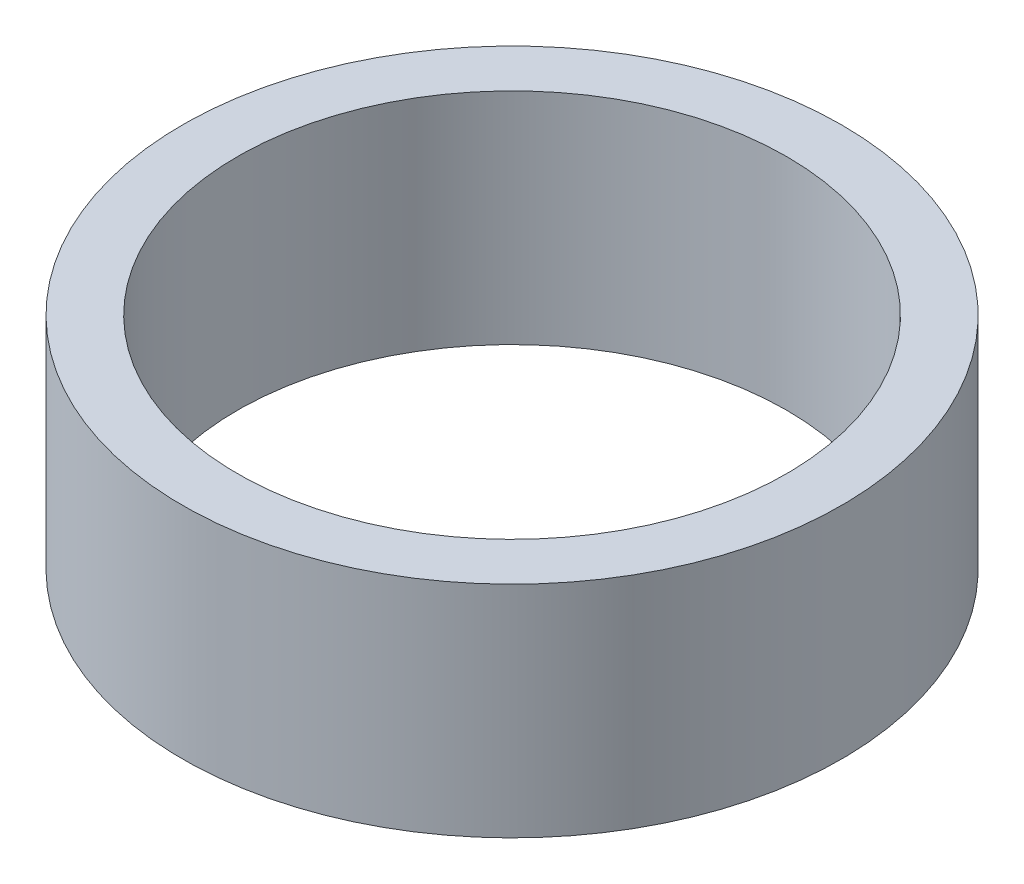
ISO-10303-21;
HEADER;
FILE_DESCRIPTION(('STEP AP214'),'2;1');
FILE_NAME('part.step','',(''),(''),'','','');
FILE_SCHEMA(('AUTOMOTIVE_DESIGN { 1 0 10303 214 1 1 1 1 }'));
ENDSEC;
DATA;
#1=APPLICATION_CONTEXT('core data for automotive mechanical design processes');
#2=APPLICATION_PROTOCOL_DEFINITION('international standard','automotive_design',2000,#1);
#3=PRODUCT_CONTEXT('',#1,'mechanical');
#4=PRODUCT('Part','Part','',(#3));
#5=PRODUCT_RELATED_PRODUCT_CATEGORY('part','',(#4));
#6=PRODUCT_DEFINITION_FORMATION('','',#4);
#7=PRODUCT_DEFINITION_CONTEXT('part definition',#1,'design');
#8=PRODUCT_DEFINITION('design','',#6,#7);
#9=PRODUCT_DEFINITION_SHAPE('','',#8);
#10=(LENGTH_UNIT() NAMED_UNIT(*) SI_UNIT(.MILLI.,.METRE.));
#11=(NAMED_UNIT(*) PLANE_ANGLE_UNIT() SI_UNIT($,.RADIAN.));
#12=(NAMED_UNIT(*) SI_UNIT($,.STERADIAN.) SOLID_ANGLE_UNIT());
#13=UNCERTAINTY_MEASURE_WITH_UNIT(LENGTH_MEASURE(1.E-05),#10,'distance_accuracy_value','');
#14=(GEOMETRIC_REPRESENTATION_CONTEXT(3) GLOBAL_UNCERTAINTY_ASSIGNED_CONTEXT((#13)) GLOBAL_UNIT_ASSIGNED_CONTEXT((#10,
#11,#12)) REPRESENTATION_CONTEXT('',''));
#15=CARTESIAN_POINT('',(0.,0.,0.));
#16=DIRECTION('',(0.,0.,1.));
#17=DIRECTION('',(1.,0.,0.));
#18=AXIS2_PLACEMENT_3D('',#15,#16,#17);
#19=CARTESIAN_POINT('',(0.,0.,0.));
#20=DIRECTION('',(0.,-1.,0.));
#21=DIRECTION('',(0.,0.,-1.));
#22=AXIS2_PLACEMENT_3D('',#19,#20,#21);
#23=CYLINDRICAL_SURFACE('',#22,1.25);
#24=CARTESIAN_POINT('',(0.,0.,0.));
#25=DIRECTION('',(0.,-1.,0.));
#26=DIRECTION('',(0.,0.,-1.));
#27=AXIS2_PLACEMENT_3D('',#24,#25,#26);
#28=CIRCLE('',#27,1.25);
#29=CARTESIAN_POINT('',(0.,0.,-1.25));
#30=VERTEX_POINT('',#29);
#31=EDGE_CURVE('E43',#30,#30,#28,.T.);
#32=ORIENTED_EDGE('',*,*,#31,.T.);
#33=EDGE_LOOP('',(#32));
#34=FACE_BOUND('',#33,.T.);
#35=CARTESIAN_POINT('',(0.,1.,0.));
#36=DIRECTION('',(0.,-1.,0.));
#37=DIRECTION('',(0.,0.,-1.));
#38=AXIS2_PLACEMENT_3D('',#35,#36,#37);
#39=CIRCLE('',#38,1.25);
#40=CARTESIAN_POINT('',(0.,1.,-1.25));
#41=VERTEX_POINT('',#40);
#42=EDGE_CURVE('E10',#41,#41,#39,.T.);
#43=ORIENTED_EDGE('',*,*,#42,.F.);
#44=EDGE_LOOP('',(#43));
#45=FACE_BOUND('',#44,.T.);
#46=ADVANCED_FACE('F29',(#34,#45),#23,.F.);
#47=CARTESIAN_POINT('',(1.25,1.,0.));
#48=DIRECTION('',(0.,1.,0.));
#49=DIRECTION('',(0.,0.,1.));
#50=AXIS2_PLACEMENT_3D('',#47,#48,#49);
#51=PLANE('',#50);
#52=ORIENTED_EDGE('',*,*,#42,.T.);
#53=EDGE_LOOP('',(#52));
#54=FACE_BOUND('',#53,.T.);
#55=CARTESIAN_POINT('',(0.,1.,0.));
#56=DIRECTION('',(0.,-1.,0.));
#57=DIRECTION('',(0.,0.,-1.));
#58=AXIS2_PLACEMENT_3D('',#55,#56,#57);
#59=CIRCLE('',#58,1.5);
#60=CARTESIAN_POINT('',(0.,1.,-1.5));
#61=VERTEX_POINT('',#60);
#62=EDGE_CURVE('E35',#61,#61,#59,.T.);
#63=ORIENTED_EDGE('',*,*,#62,.F.);
#64=EDGE_LOOP('',(#63));
#65=FACE_BOUND('',#64,.T.);
#66=ADVANCED_FACE('F59',(#54,#65),#51,.T.);
#67=CARTESIAN_POINT('',(0.,0.,0.));
#68=DIRECTION('',(0.,-1.,0.));
#69=DIRECTION('',(0.,0.,-1.));
#70=AXIS2_PLACEMENT_3D('',#67,#68,#69);
#71=CYLINDRICAL_SURFACE('',#70,1.5);
#72=ORIENTED_EDGE('',*,*,#62,.T.);
#73=EDGE_LOOP('',(#72));
#74=FACE_BOUND('',#73,.T.);
#75=CARTESIAN_POINT('',(0.,0.,0.));
#76=DIRECTION('',(0.,-1.,0.));
#77=DIRECTION('',(0.,0.,-1.));
#78=AXIS2_PLACEMENT_3D('',#75,#76,#77);
#79=CIRCLE('',#78,1.5);
#80=CARTESIAN_POINT('',(0.,0.,-1.5));
#81=VERTEX_POINT('',#80);
#82=EDGE_CURVE('E39',#81,#81,#79,.T.);
#83=ORIENTED_EDGE('',*,*,#82,.F.);
#84=EDGE_LOOP('',(#83));
#85=FACE_BOUND('',#84,.T.);
#86=ADVANCED_FACE('F53',(#74,#85),#71,.T.);
#87=CARTESIAN_POINT('',(1.25,0.,0.));
#88=DIRECTION('',(0.,-1.,0.));
#89=DIRECTION('',(0.,0.,-1.));
#90=AXIS2_PLACEMENT_3D('',#87,#88,#89);
#91=PLANE('',#90);
#92=ORIENTED_EDGE('',*,*,#82,.T.);
#93=EDGE_LOOP('',(#92));
#94=FACE_BOUND('',#93,.T.);
#95=ORIENTED_EDGE('',*,*,#31,.F.);
#96=EDGE_LOOP('',(#95));
#97=FACE_BOUND('',#96,.T.);
#98=ADVANCED_FACE('F51',(#94,#97),#91,.T.);
#99=CLOSED_SHELL('',(#46,#66,#86,#98));
#100=MANIFOLD_SOLID_BREP('B2',#99);
#101=ADVANCED_BREP_SHAPE_REPRESENTATION('',(#18,#100),#14);
#102=SHAPE_DEFINITION_REPRESENTATION(#9,#101);
ENDSEC;
END-ISO-10303-21;
